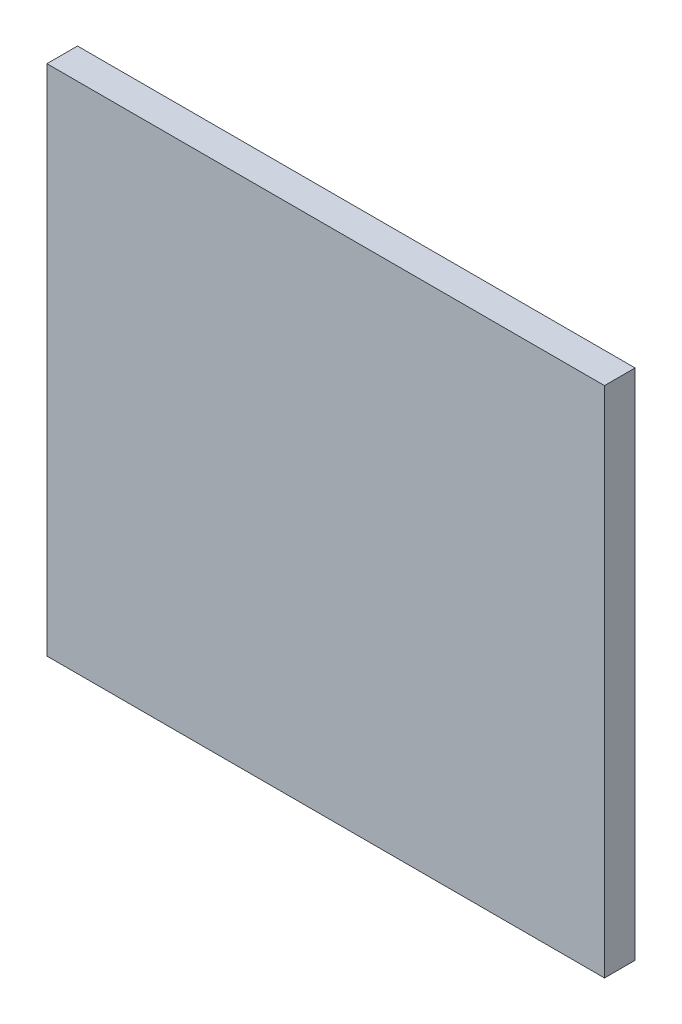
ISO-10303-21;
HEADER;
FILE_DESCRIPTION(('STEP AP214'),'2;1');
FILE_NAME('part.step','',(''),(''),'','','');
FILE_SCHEMA(('AUTOMOTIVE_DESIGN { 1 0 10303 214 1 1 1 1 }'));
ENDSEC;
DATA;
#1=APPLICATION_CONTEXT('core data for automotive mechanical design processes');
#2=APPLICATION_PROTOCOL_DEFINITION('international standard','automotive_design',2000,#1);
#3=PRODUCT_CONTEXT('',#1,'mechanical');
#4=PRODUCT('Part','Part','',(#3));
#5=PRODUCT_RELATED_PRODUCT_CATEGORY('part','',(#4));
#6=PRODUCT_DEFINITION_FORMATION('','',#4);
#7=PRODUCT_DEFINITION_CONTEXT('part definition',#1,'design');
#8=PRODUCT_DEFINITION('design','',#6,#7);
#9=PRODUCT_DEFINITION_SHAPE('','',#8);
#10=(LENGTH_UNIT() NAMED_UNIT(*) SI_UNIT(.MILLI.,.METRE.));
#11=(NAMED_UNIT(*) PLANE_ANGLE_UNIT() SI_UNIT($,.RADIAN.));
#12=(NAMED_UNIT(*) SI_UNIT($,.STERADIAN.) SOLID_ANGLE_UNIT());
#13=UNCERTAINTY_MEASURE_WITH_UNIT(LENGTH_MEASURE(1.E-05),#10,'distance_accuracy_value','');
#14=(GEOMETRIC_REPRESENTATION_CONTEXT(3) GLOBAL_UNCERTAINTY_ASSIGNED_CONTEXT((#13)) GLOBAL_UNIT_ASSIGNED_CONTEXT((#10,
#11,#12)) REPRESENTATION_CONTEXT('',''));
#15=CARTESIAN_POINT('',(0.,0.,0.));
#16=DIRECTION('',(0.,0.,1.));
#17=DIRECTION('',(1.,0.,0.));
#18=AXIS2_PLACEMENT_3D('',#15,#16,#17);
#19=CARTESIAN_POINT('',(-13792.5570127627,-13067.058376477,-790.));
#20=DIRECTION('',(0.,-1.,0.));
#21=DIRECTION('',(0.,0.,-1.));
#22=AXIS2_PLACEMENT_3D('',#19,#20,#21);
#23=PLANE('',#22);
#24=DIRECTION('',(0.,0.,1.));
#25=VECTOR('',#24,1.);
#26=CARTESIAN_POINT('',(15007.4429872374,-13067.058376477,-790.));
#27=LINE('',#26,#25);
#28=CARTESIAN_POINT('',(15007.4429872374,-13067.058376477,-790.));
#29=VERTEX_POINT('',#28);
#30=CARTESIAN_POINT('',(15007.4429872374,-13067.058376477,790.));
#31=VERTEX_POINT('',#30);
#32=EDGE_CURVE('E36',#29,#31,#27,.T.);
#33=ORIENTED_EDGE('',*,*,#32,.T.);
#34=DIRECTION('',(1.,0.,0.));
#35=VECTOR('',#34,1.);
#36=CARTESIAN_POINT('',(-13792.5570127627,-13067.058376477,790.));
#37=LINE('',#36,#35);
#38=CARTESIAN_POINT('',(-13792.5570127627,-13067.058376477,790.));
#39=VERTEX_POINT('',#38);
#40=EDGE_CURVE('E73',#39,#31,#37,.T.);
#41=ORIENTED_EDGE('',*,*,#40,.F.);
#42=DIRECTION('',(0.,0.,1.));
#43=VECTOR('',#42,1.);
#44=CARTESIAN_POINT('',(-13792.5570127627,-13067.058376477,-790.));
#45=LINE('',#44,#43);
#46=CARTESIAN_POINT('',(-13792.5570127627,-13067.058376477,-790.));
#47=VERTEX_POINT('',#46);
#48=EDGE_CURVE('E11',#47,#39,#45,.T.);
#49=ORIENTED_EDGE('',*,*,#48,.F.);
#50=DIRECTION('',(1.,0.,0.));
#51=VECTOR('',#50,1.);
#52=CARTESIAN_POINT('',(-13792.5570127627,-13067.058376477,-790.));
#53=LINE('',#52,#51);
#54=EDGE_CURVE('E74',#47,#29,#53,.T.);
#55=ORIENTED_EDGE('',*,*,#54,.T.);
#56=EDGE_LOOP('',(#33,#41,#49,#55));
#57=FACE_BOUND('',#56,.T.);
#58=ADVANCED_FACE('F33',(#57),#23,.T.);
#59=CARTESIAN_POINT('',(-13792.5570127627,-13067.058376477,-790.));
#60=DIRECTION('',(-1.,0.,0.));
#61=DIRECTION('',(0.,0.,1.));
#62=AXIS2_PLACEMENT_3D('',#59,#60,#61);
#63=PLANE('',#62);
#64=ORIENTED_EDGE('',*,*,#48,.T.);
#65=DIRECTION('',(0.,-1.,0.));
#66=VECTOR('',#65,1.);
#67=CARTESIAN_POINT('',(-13792.5570127627,-13067.058376477,790.));
#68=LINE('',#67,#66);
#69=CARTESIAN_POINT('',(-13792.5570127627,13432.941623523,790.));
#70=VERTEX_POINT('',#69);
#71=EDGE_CURVE('E90',#70,#39,#68,.T.);
#72=ORIENTED_EDGE('',*,*,#71,.F.);
#73=DIRECTION('',(0.,0.,1.));
#74=VECTOR('',#73,1.);
#75=CARTESIAN_POINT('',(-13792.5570127627,13432.941623523,-790.));
#76=LINE('',#75,#74);
#77=CARTESIAN_POINT('',(-13792.5570127627,13432.941623523,-790.));
#78=VERTEX_POINT('',#77);
#79=EDGE_CURVE('E41',#78,#70,#76,.T.);
#80=ORIENTED_EDGE('',*,*,#79,.F.);
#81=DIRECTION('',(0.,-1.,0.));
#82=VECTOR('',#81,1.);
#83=CARTESIAN_POINT('',(-13792.5570127627,-13067.058376477,-790.));
#84=LINE('',#83,#82);
#85=EDGE_CURVE('E79',#78,#47,#84,.T.);
#86=ORIENTED_EDGE('',*,*,#85,.T.);
#87=EDGE_LOOP('',(#64,#72,#80,#86));
#88=FACE_BOUND('',#87,.T.);
#89=ADVANCED_FACE('F105',(#88),#63,.T.);
#90=CARTESIAN_POINT('',(-13792.5570127627,13432.941623523,-790.));
#91=DIRECTION('',(0.,1.,0.));
#92=DIRECTION('',(0.,0.,1.));
#93=AXIS2_PLACEMENT_3D('',#90,#91,#92);
#94=PLANE('',#93);
#95=ORIENTED_EDGE('',*,*,#79,.T.);
#96=DIRECTION('',(-1.,0.,0.));
#97=VECTOR('',#96,1.);
#98=CARTESIAN_POINT('',(-13792.5570127627,13432.941623523,790.));
#99=LINE('',#98,#97);
#100=CARTESIAN_POINT('',(15007.4429872374,13432.941623523,790.));
#101=VERTEX_POINT('',#100);
#102=EDGE_CURVE('E86',#101,#70,#99,.T.);
#103=ORIENTED_EDGE('',*,*,#102,.F.);
#104=DIRECTION('',(0.,0.,1.));
#105=VECTOR('',#104,1.);
#106=CARTESIAN_POINT('',(15007.4429872374,13432.941623523,-790.));
#107=LINE('',#106,#105);
#108=CARTESIAN_POINT('',(15007.4429872374,13432.941623523,-790.));
#109=VERTEX_POINT('',#108);
#110=EDGE_CURVE('E78',#109,#101,#107,.T.);
#111=ORIENTED_EDGE('',*,*,#110,.F.);
#112=DIRECTION('',(-1.,0.,0.));
#113=VECTOR('',#112,1.);
#114=CARTESIAN_POINT('',(-13792.5570127627,13432.941623523,-790.));
#115=LINE('',#114,#113);
#116=EDGE_CURVE('E98',#109,#78,#115,.T.);
#117=ORIENTED_EDGE('',*,*,#116,.T.);
#118=EDGE_LOOP('',(#95,#103,#111,#117));
#119=FACE_BOUND('',#118,.T.);
#120=ADVANCED_FACE('F102',(#119),#94,.T.);
#121=CARTESIAN_POINT('',(15007.4429872374,-13067.058376477,-790.));
#122=DIRECTION('',(1.,0.,0.));
#123=DIRECTION('',(0.,0.,-1.));
#124=AXIS2_PLACEMENT_3D('',#121,#122,#123);
#125=PLANE('',#124);
#126=ORIENTED_EDGE('',*,*,#110,.T.);
#127=DIRECTION('',(0.,1.,0.));
#128=VECTOR('',#127,1.);
#129=CARTESIAN_POINT('',(15007.4429872374,-13067.058376477,790.));
#130=LINE('',#129,#128);
#131=EDGE_CURVE('E81',#31,#101,#130,.T.);
#132=ORIENTED_EDGE('',*,*,#131,.F.);
#133=ORIENTED_EDGE('',*,*,#32,.F.);
#134=DIRECTION('',(0.,1.,0.));
#135=VECTOR('',#134,1.);
#136=CARTESIAN_POINT('',(15007.4429872374,-13067.058376477,-790.));
#137=LINE('',#136,#135);
#138=EDGE_CURVE('E96',#29,#109,#137,.T.);
#139=ORIENTED_EDGE('',*,*,#138,.T.);
#140=EDGE_LOOP('',(#126,#132,#133,#139));
#141=FACE_BOUND('',#140,.T.);
#142=ADVANCED_FACE('F82',(#141),#125,.T.);
#143=CARTESIAN_POINT('',(0.,0.,-790.));
#144=DIRECTION('',(0.,0.,1.));
#145=DIRECTION('',(1.,0.,0.));
#146=AXIS2_PLACEMENT_3D('',#143,#144,#145);
#147=PLANE('',#146);
#148=ORIENTED_EDGE('',*,*,#54,.F.);
#149=ORIENTED_EDGE('',*,*,#85,.F.);
#150=ORIENTED_EDGE('',*,*,#116,.F.);
#151=ORIENTED_EDGE('',*,*,#138,.F.);
#152=EDGE_LOOP('',(#148,#149,#150,#151));
#153=FACE_BOUND('',#152,.T.);
#154=ADVANCED_FACE('F107',(#153),#147,.F.);
#155=CARTESIAN_POINT('',(0.,0.,790.));
#156=DIRECTION('',(0.,0.,1.));
#157=DIRECTION('',(1.,0.,0.));
#158=AXIS2_PLACEMENT_3D('',#155,#156,#157);
#159=PLANE('',#158);
#160=ORIENTED_EDGE('',*,*,#40,.T.);
#161=ORIENTED_EDGE('',*,*,#131,.T.);
#162=ORIENTED_EDGE('',*,*,#102,.T.);
#163=ORIENTED_EDGE('',*,*,#71,.T.);
#164=EDGE_LOOP('',(#160,#161,#162,#163));
#165=FACE_BOUND('',#164,.T.);
#166=ADVANCED_FACE('F89',(#165),#159,.T.);
#167=CLOSED_SHELL('',(#58,#89,#120,#142,#154,#166));
#168=MANIFOLD_SOLID_BREP('B2',#167);
#169=ADVANCED_BREP_SHAPE_REPRESENTATION('',(#18,#168),#14);
#170=SHAPE_DEFINITION_REPRESENTATION(#9,#169);
ENDSEC;
END-ISO-10303-21;
